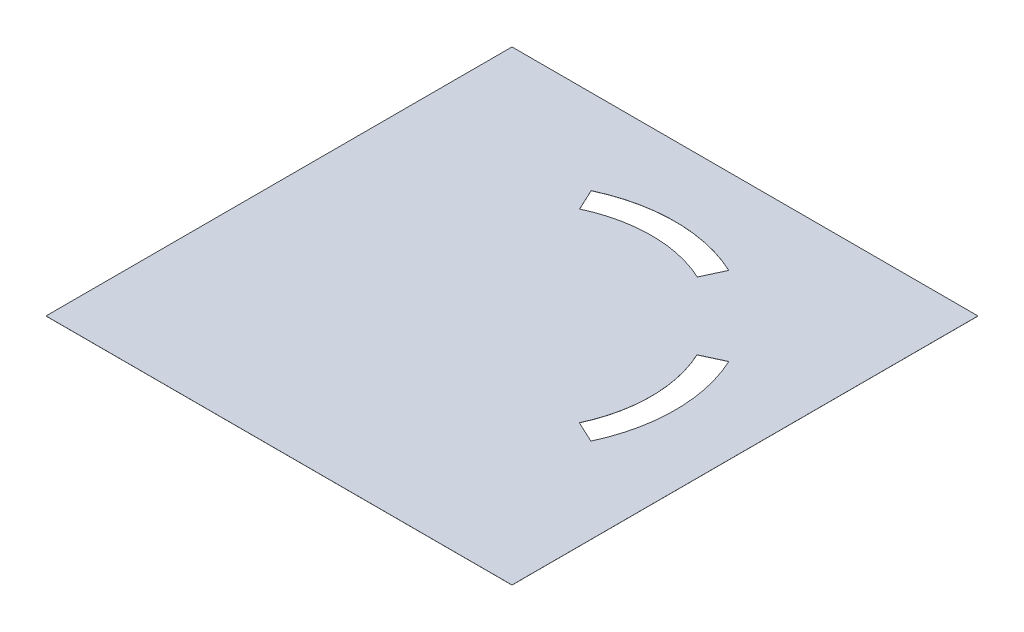
ISO-10303-21;
HEADER;
FILE_DESCRIPTION(('STEP AP214'),'2;1');
FILE_NAME('part.step','',(''),(''),'','','');
FILE_SCHEMA(('AUTOMOTIVE_DESIGN { 1 0 10303 214 1 1 1 1 }'));
ENDSEC;
DATA;
#1=APPLICATION_CONTEXT('core data for automotive mechanical design processes');
#2=APPLICATION_PROTOCOL_DEFINITION('international standard','automotive_design',2000,#1);
#3=PRODUCT_CONTEXT('',#1,'mechanical');
#4=PRODUCT('Part','Part','',(#3));
#5=PRODUCT_RELATED_PRODUCT_CATEGORY('part','',(#4));
#6=PRODUCT_DEFINITION_FORMATION('','',#4);
#7=PRODUCT_DEFINITION_CONTEXT('part definition',#1,'design');
#8=PRODUCT_DEFINITION('design','',#6,#7);
#9=PRODUCT_DEFINITION_SHAPE('','',#8);
#10=(LENGTH_UNIT() NAMED_UNIT(*) SI_UNIT(.MILLI.,.METRE.));
#11=(NAMED_UNIT(*) PLANE_ANGLE_UNIT() SI_UNIT($,.RADIAN.));
#12=(NAMED_UNIT(*) SI_UNIT($,.STERADIAN.) SOLID_ANGLE_UNIT());
#13=UNCERTAINTY_MEASURE_WITH_UNIT(LENGTH_MEASURE(1.E-05),#10,'distance_accuracy_value','');
#14=(GEOMETRIC_REPRESENTATION_CONTEXT(3) GLOBAL_UNCERTAINTY_ASSIGNED_CONTEXT((#13)) GLOBAL_UNIT_ASSIGNED_CONTEXT((#10,
#11,#12)) REPRESENTATION_CONTEXT('',''));
#15=CARTESIAN_POINT('',(0.,0.,0.));
#16=DIRECTION('',(0.,0.,1.));
#17=DIRECTION('',(1.,0.,0.));
#18=AXIS2_PLACEMENT_3D('',#15,#16,#17);
#19=CARTESIAN_POINT('',(26.5152534382806,0.015,-26.5149583428723));
#20=DIRECTION('',(0.,-1.,0.));
#21=DIRECTION('',(0.,0.,-1.));
#22=AXIS2_PLACEMENT_3D('',#19,#20,#21);
#23=PLANE('',#22);
#24=CARTESIAN_POINT('',(53.2898031206338,0.015,-53.2975764354662));
#25=DIRECTION('',(0.,-1.,0.));
#26=DIRECTION('',(0.,0.,-1.));
#27=AXIS2_PLACEMENT_3D('',#24,#25,#26);
#28=CIRCLE('',#27,16.0051180925938);
#29=CARTESIAN_POINT('',(46.5257479333873,0.015,-67.8031395952252));
#30=VERTEX_POINT('',#29);
#31=CARTESIAN_POINT('',(60.0538583078804,0.015,-67.8031395952251));
#32=VERTEX_POINT('',#31);
#33=EDGE_CURVE('E159',#30,#32,#28,.T.);
#34=ORIENTED_EDGE('',*,*,#33,.F.);
#35=DIRECTION('',(0.422618261740692,0.,0.906307787036653));
#36=VECTOR('',#35,1.);
#37=CARTESIAN_POINT('',(46.5257479333873,0.015,-67.8031395952252));
#38=LINE('',#37,#36);
#39=CARTESIAN_POINT('',(45.3628872132601,0.015,-70.2969024571269));
#40=VERTEX_POINT('',#39);
#41=EDGE_CURVE('E167',#40,#30,#38,.T.);
#42=ORIENTED_EDGE('',*,*,#41,.F.);
#43=CARTESIAN_POINT('',(53.2506374142511,0.015,-53.4572668260534));
#44=DIRECTION('',(0.,1.,0.));
#45=DIRECTION('',(0.,0.,-1.));
#46=AXIS2_PLACEMENT_3D('',#43,#44,#45);
#47=CIRCLE('',#46,18.5954277020066);
#48=CARTESIAN_POINT('',(61.2026196633013,0.015,-70.2666662719392));
#49=VERTEX_POINT('',#48);
#50=EDGE_CURVE('E164',#49,#40,#47,.T.);
#51=ORIENTED_EDGE('',*,*,#50,.F.);
#52=DIRECTION('',(0.422618261740697,0.,-0.906307787036651));
#53=VECTOR('',#52,1.);
#54=CARTESIAN_POINT('',(60.0538583078804,0.015,-67.8031395952251));
#55=LINE('',#54,#53);
#56=EDGE_CURVE('E161',#32,#49,#55,.T.);
#57=ORIENTED_EDGE('',*,*,#56,.F.);
#58=EDGE_LOOP('',(#34,#42,#51,#57));
#59=FACE_BOUND('',#58,.T.);
#60=DIRECTION('',(1.,0.,0.));
#61=VECTOR('',#60,1.);
#62=CARTESIAN_POINT('',(26.5152534382806,0.015,-26.5149583428723));
#63=LINE('',#62,#61);
#64=CARTESIAN_POINT('',(26.5152534382806,0.015,-26.5149583428723));
#65=VERTEX_POINT('',#64);
#66=CARTESIAN_POINT('',(80.0502534382806,0.015,-26.5149583428723));
#67=VERTEX_POINT('',#66);
#68=EDGE_CURVE('E190',#65,#67,#63,.T.);
#69=ORIENTED_EDGE('',*,*,#68,.T.);
#70=DIRECTION('',(0.,0.,-1.));
#71=VECTOR('',#70,1.);
#72=CARTESIAN_POINT('',(80.0502534382806,0.015,-80.0499583428723));
#73=LINE('',#72,#71);
#74=CARTESIAN_POINT('',(80.0502534382806,0.015,-80.0499583428723));
#75=VERTEX_POINT('',#74);
#76=EDGE_CURVE('E193',#67,#75,#73,.T.);
#77=ORIENTED_EDGE('',*,*,#76,.T.);
#78=DIRECTION('',(-1.,0.,0.));
#79=VECTOR('',#78,1.);
#80=CARTESIAN_POINT('',(26.5152534382806,0.015,-80.0499583428723));
#81=LINE('',#80,#79);
#82=CARTESIAN_POINT('',(26.5152534382806,0.015,-80.0499583428723));
#83=VERTEX_POINT('',#82);
#84=EDGE_CURVE('E196',#75,#83,#81,.T.);
#85=ORIENTED_EDGE('',*,*,#84,.T.);
#86=DIRECTION('',(0.,0.,1.));
#87=VECTOR('',#86,1.);
#88=CARTESIAN_POINT('',(26.5152534382806,0.015,-26.5149583428723));
#89=LINE('',#88,#87);
#90=EDGE_CURVE('E198',#83,#65,#89,.T.);
#91=ORIENTED_EDGE('',*,*,#90,.T.);
#92=EDGE_LOOP('',(#69,#77,#85,#91));
#93=FACE_BOUND('',#92,.T.);
#94=CARTESIAN_POINT('',(53.2827534382806,0.015,-53.2824583428723));
#95=DIRECTION('',(0.,-1.,0.));
#96=DIRECTION('',(0.,0.,-1.));
#97=AXIS2_PLACEMENT_3D('',#94,#95,#96);
#98=CIRCLE('',#97,15.99);
#99=CARTESIAN_POINT('',(67.7746149529967,0.015,-60.0401243481061));
#100=VERTEX_POINT('',#99);
#101=CARTESIAN_POINT('',(67.7746149529967,0.015,-46.5247923376385));
#102=VERTEX_POINT('',#101);
#103=EDGE_CURVE('E123',#100,#102,#98,.T.);
#104=ORIENTED_EDGE('',*,*,#103,.F.);
#105=DIRECTION('',(-0.906307787036649,0.,0.422618261740701));
#106=VECTOR('',#105,1.);
#107=CARTESIAN_POINT('',(67.7746149529967,0.015,-60.0401243481061));
#108=LINE('',#107,#106);
#109=CARTESIAN_POINT('',(70.2669613673474,0.015,-61.2023245678931));
#110=VERTEX_POINT('',#109);
#111=EDGE_CURVE('E145',#110,#100,#108,.T.);
#112=ORIENTED_EDGE('',*,*,#111,.F.);
#113=CARTESIAN_POINT('',(53.2827534382806,0.015,-53.2824583428723));
#114=DIRECTION('',(0.,1.,0.));
#115=DIRECTION('',(0.,0.,-1.));
#116=AXIS2_PLACEMENT_3D('',#113,#114,#115);
#117=CIRCLE('',#116,18.74);
#118=CARTESIAN_POINT('',(70.2669613673474,0.015,-45.3625921178516));
#119=VERTEX_POINT('',#118);
#120=EDGE_CURVE('E143',#119,#110,#117,.T.);
#121=ORIENTED_EDGE('',*,*,#120,.F.);
#122=DIRECTION('',(0.906307787036649,0.,0.422618261740701));
#123=VECTOR('',#122,1.);
#124=CARTESIAN_POINT('',(67.7746149529967,0.015,-46.5247923376385));
#125=LINE('',#124,#123);
#126=EDGE_CURVE('E131',#102,#119,#125,.T.);
#127=ORIENTED_EDGE('',*,*,#126,.F.);
#128=EDGE_LOOP('',(#104,#112,#121,#127));
#129=FACE_BOUND('',#128,.T.);
#130=ADVANCED_FACE('F34',(#59,#93,#129),#23,.F.);
#131=CARTESIAN_POINT('',(26.5152534382806,0.005,-26.5149583428723));
#132=DIRECTION('',(0.,-1.,0.));
#133=DIRECTION('',(0.,0.,-1.));
#134=AXIS2_PLACEMENT_3D('',#131,#132,#133);
#135=PLANE('',#134);
#136=DIRECTION('',(1.,0.,0.));
#137=VECTOR('',#136,1.);
#138=CARTESIAN_POINT('',(26.5152534382806,0.005,-26.5149583428723));
#139=LINE('',#138,#137);
#140=CARTESIAN_POINT('',(26.5152534382806,0.005,-26.5149583428723));
#141=VERTEX_POINT('',#140);
#142=CARTESIAN_POINT('',(80.0502534382806,0.005,-26.5149583428723));
#143=VERTEX_POINT('',#142);
#144=EDGE_CURVE('E189',#141,#143,#139,.T.);
#145=ORIENTED_EDGE('',*,*,#144,.F.);
#146=DIRECTION('',(0.,0.,1.));
#147=VECTOR('',#146,1.);
#148=CARTESIAN_POINT('',(26.5152534382806,0.005,-26.5149583428723));
#149=LINE('',#148,#147);
#150=CARTESIAN_POINT('',(26.5152534382806,0.005,-80.0499583428723));
#151=VERTEX_POINT('',#150);
#152=EDGE_CURVE('E194',#151,#141,#149,.T.);
#153=ORIENTED_EDGE('',*,*,#152,.F.);
#154=DIRECTION('',(-1.,0.,0.));
#155=VECTOR('',#154,1.);
#156=CARTESIAN_POINT('',(26.5152534382806,0.005,-80.0499583428723));
#157=LINE('',#156,#155);
#158=CARTESIAN_POINT('',(80.0502534382806,0.005,-80.0499583428723));
#159=VERTEX_POINT('',#158);
#160=EDGE_CURVE('E205',#159,#151,#157,.T.);
#161=ORIENTED_EDGE('',*,*,#160,.F.);
#162=DIRECTION('',(0.,0.,-1.));
#163=VECTOR('',#162,1.);
#164=CARTESIAN_POINT('',(80.0502534382806,0.005,-80.0499583428723));
#165=LINE('',#164,#163);
#166=EDGE_CURVE('E203',#143,#159,#165,.T.);
#167=ORIENTED_EDGE('',*,*,#166,.F.);
#168=EDGE_LOOP('',(#145,#153,#161,#167));
#169=FACE_BOUND('',#168,.T.);
#170=DIRECTION('',(0.422618261740692,0.,0.906307787036653));
#171=VECTOR('',#170,1.);
#172=CARTESIAN_POINT('',(46.5257479333873,0.005,-67.8031395952252));
#173=LINE('',#172,#171);
#174=CARTESIAN_POINT('',(45.3628872132601,0.005,-70.2969024571269));
#175=VERTEX_POINT('',#174);
#176=CARTESIAN_POINT('',(46.5257479333873,0.005,-67.8031395952252));
#177=VERTEX_POINT('',#176);
#178=EDGE_CURVE('E162',#175,#177,#173,.T.);
#179=ORIENTED_EDGE('',*,*,#178,.T.);
#180=CARTESIAN_POINT('',(53.2898031206338,0.005,-53.2975764354662));
#181=DIRECTION('',(0.,-1.,0.));
#182=DIRECTION('',(0.,0.,-1.));
#183=AXIS2_PLACEMENT_3D('',#180,#181,#182);
#184=CIRCLE('',#183,16.0051180925938);
#185=CARTESIAN_POINT('',(60.0538583078804,0.005,-67.8031395952251));
#186=VERTEX_POINT('',#185);
#187=EDGE_CURVE('E139',#177,#186,#184,.T.);
#188=ORIENTED_EDGE('',*,*,#187,.T.);
#189=DIRECTION('',(0.422618261740697,0.,-0.906307787036651));
#190=VECTOR('',#189,1.);
#191=CARTESIAN_POINT('',(60.0538583078804,0.005,-67.8031395952251));
#192=LINE('',#191,#190);
#193=CARTESIAN_POINT('',(61.2026196633013,0.005,-70.2666662719392));
#194=VERTEX_POINT('',#193);
#195=EDGE_CURVE('E172',#186,#194,#192,.T.);
#196=ORIENTED_EDGE('',*,*,#195,.T.);
#197=CARTESIAN_POINT('',(53.2506374142511,0.005,-53.4572668260534));
#198=DIRECTION('',(0.,1.,0.));
#199=DIRECTION('',(0.,0.,-1.));
#200=AXIS2_PLACEMENT_3D('',#197,#198,#199);
#201=CIRCLE('',#200,18.5954277020066);
#202=EDGE_CURVE('E175',#194,#175,#201,.T.);
#203=ORIENTED_EDGE('',*,*,#202,.T.);
#204=EDGE_LOOP('',(#179,#188,#196,#203));
#205=FACE_BOUND('',#204,.T.);
#206=DIRECTION('',(-0.906307787036649,0.,0.422618261740701));
#207=VECTOR('',#206,1.);
#208=CARTESIAN_POINT('',(67.7746149529967,0.005,-60.0401243481061));
#209=LINE('',#208,#207);
#210=CARTESIAN_POINT('',(70.2669613673474,0.005,-61.2023245678931));
#211=VERTEX_POINT('',#210);
#212=CARTESIAN_POINT('',(67.7746149529966,0.005,-60.0401243481061));
#213=VERTEX_POINT('',#212);
#214=EDGE_CURVE('E132',#211,#213,#209,.T.);
#215=ORIENTED_EDGE('',*,*,#214,.T.);
#216=CARTESIAN_POINT('',(53.2827534382806,0.005,-53.2824583428723));
#217=DIRECTION('',(0.,-1.,0.));
#218=DIRECTION('',(0.,0.,-1.));
#219=AXIS2_PLACEMENT_3D('',#216,#217,#218);
#220=CIRCLE('',#219,15.99);
#221=CARTESIAN_POINT('',(67.7746149529967,0.005,-46.5247923376385));
#222=VERTEX_POINT('',#221);
#223=EDGE_CURVE('E57',#213,#222,#220,.T.);
#224=ORIENTED_EDGE('',*,*,#223,.T.);
#225=DIRECTION('',(0.906307787036649,0.,0.422618261740701));
#226=VECTOR('',#225,1.);
#227=CARTESIAN_POINT('',(67.7746149529967,0.005,-46.5247923376385));
#228=LINE('',#227,#226);
#229=CARTESIAN_POINT('',(70.2669613673474,0.005,-45.3625921178516));
#230=VERTEX_POINT('',#229);
#231=EDGE_CURVE('E138',#222,#230,#228,.T.);
#232=ORIENTED_EDGE('',*,*,#231,.T.);
#233=CARTESIAN_POINT('',(53.2827534382806,0.005,-53.2824583428723));
#234=DIRECTION('',(0.,1.,0.));
#235=DIRECTION('',(0.,0.,-1.));
#236=AXIS2_PLACEMENT_3D('',#233,#234,#235);
#237=CIRCLE('',#236,18.74);
#238=EDGE_CURVE('E151',#230,#211,#237,.T.);
#239=ORIENTED_EDGE('',*,*,#238,.T.);
#240=EDGE_LOOP('',(#215,#224,#232,#239));
#241=FACE_BOUND('',#240,.T.);
#242=ADVANCED_FACE('F223',(#169,#205,#241),#135,.T.);
#243=CARTESIAN_POINT('',(26.5152534382806,0.015,-26.5149583428723));
#244=DIRECTION('',(0.,0.,-1.));
#245=DIRECTION('',(-1.,0.,0.));
#246=AXIS2_PLACEMENT_3D('',#243,#244,#245);
#247=PLANE('',#246);
#248=ORIENTED_EDGE('',*,*,#144,.T.);
#249=DIRECTION('',(0.,-1.,0.));
#250=VECTOR('',#249,1.);
#251=CARTESIAN_POINT('',(80.0502534382806,0.015,-26.5149583428723));
#252=LINE('',#251,#250);
#253=EDGE_CURVE('E11',#67,#143,#252,.T.);
#254=ORIENTED_EDGE('',*,*,#253,.F.);
#255=ORIENTED_EDGE('',*,*,#68,.F.);
#256=DIRECTION('',(0.,-1.,0.));
#257=VECTOR('',#256,1.);
#258=CARTESIAN_POINT('',(26.5152534382806,0.015,-26.5149583428723));
#259=LINE('',#258,#257);
#260=EDGE_CURVE('E200',#65,#141,#259,.T.);
#261=ORIENTED_EDGE('',*,*,#260,.T.);
#262=EDGE_LOOP('',(#248,#254,#255,#261));
#263=FACE_BOUND('',#262,.T.);
#264=ADVANCED_FACE('F36',(#263),#247,.F.);
#265=CARTESIAN_POINT('',(80.0502534382806,0.015,-80.0499583428723));
#266=DIRECTION('',(-1.,0.,0.));
#267=DIRECTION('',(0.,0.,1.));
#268=AXIS2_PLACEMENT_3D('',#265,#266,#267);
#269=PLANE('',#268);
#270=ORIENTED_EDGE('',*,*,#166,.T.);
#271=DIRECTION('',(0.,-1.,0.));
#272=VECTOR('',#271,1.);
#273=CARTESIAN_POINT('',(80.0502534382806,0.015,-80.0499583428723));
#274=LINE('',#273,#272);
#275=EDGE_CURVE('E42',#75,#159,#274,.T.);
#276=ORIENTED_EDGE('',*,*,#275,.F.);
#277=ORIENTED_EDGE('',*,*,#76,.F.);
#278=ORIENTED_EDGE('',*,*,#253,.T.);
#279=EDGE_LOOP('',(#270,#276,#277,#278));
#280=FACE_BOUND('',#279,.T.);
#281=ADVANCED_FACE('F233',(#280),#269,.F.);
#282=CARTESIAN_POINT('',(26.5152534382806,0.015,-80.0499583428723));
#283=DIRECTION('',(0.,0.,1.));
#284=DIRECTION('',(1.,0.,0.));
#285=AXIS2_PLACEMENT_3D('',#282,#283,#284);
#286=PLANE('',#285);
#287=ORIENTED_EDGE('',*,*,#160,.T.);
#288=DIRECTION('',(0.,-1.,0.));
#289=VECTOR('',#288,1.);
#290=CARTESIAN_POINT('',(26.5152534382806,0.015,-80.0499583428723));
#291=LINE('',#290,#289);
#292=EDGE_CURVE('E210',#83,#151,#291,.T.);
#293=ORIENTED_EDGE('',*,*,#292,.F.);
#294=ORIENTED_EDGE('',*,*,#84,.F.);
#295=ORIENTED_EDGE('',*,*,#275,.T.);
#296=EDGE_LOOP('',(#287,#293,#294,#295));
#297=FACE_BOUND('',#296,.T.);
#298=ADVANCED_FACE('F217',(#297),#286,.F.);
#299=CARTESIAN_POINT('',(26.5152534382806,0.015,-26.5149583428723));
#300=DIRECTION('',(1.,0.,0.));
#301=DIRECTION('',(0.,0.,-1.));
#302=AXIS2_PLACEMENT_3D('',#299,#300,#301);
#303=PLANE('',#302);
#304=ORIENTED_EDGE('',*,*,#152,.T.);
#305=ORIENTED_EDGE('',*,*,#260,.F.);
#306=ORIENTED_EDGE('',*,*,#90,.F.);
#307=ORIENTED_EDGE('',*,*,#292,.T.);
#308=EDGE_LOOP('',(#304,#305,#306,#307));
#309=FACE_BOUND('',#308,.T.);
#310=ADVANCED_FACE('F227',(#309),#303,.F.);
#311=CARTESIAN_POINT('',(53.2898031206338,0.015,-53.2975764354662));
#312=DIRECTION('',(0.,-1.,0.));
#313=DIRECTION('',(0.,0.,-1.));
#314=AXIS2_PLACEMENT_3D('',#311,#312,#313);
#315=CYLINDRICAL_SURFACE('',#314,16.0051180925938);
#316=ORIENTED_EDGE('',*,*,#187,.F.);
#317=DIRECTION('',(0.,-1.,0.));
#318=VECTOR('',#317,1.);
#319=CARTESIAN_POINT('',(46.5257479333873,0.015,-67.8031395952252));
#320=LINE('',#319,#318);
#321=EDGE_CURVE('E169',#30,#177,#320,.T.);
#322=ORIENTED_EDGE('',*,*,#321,.F.);
#323=ORIENTED_EDGE('',*,*,#33,.T.);
#324=DIRECTION('',(0.,-1.,0.));
#325=VECTOR('',#324,1.);
#326=CARTESIAN_POINT('',(60.0538583078804,0.015,-67.8031395952251));
#327=LINE('',#326,#325);
#328=EDGE_CURVE('E186',#32,#186,#327,.T.);
#329=ORIENTED_EDGE('',*,*,#328,.T.);
#330=EDGE_LOOP('',(#316,#322,#323,#329));
#331=FACE_BOUND('',#330,.T.);
#332=ADVANCED_FACE('F249',(#331),#315,.T.);
#333=CARTESIAN_POINT('',(60.0538583078804,0.015,-67.8031395952251));
#334=DIRECTION('',(-0.906307787036651,0.,-0.422618261740697));
#335=DIRECTION('',(-0.422618261740697,0.,0.906307787036651));
#336=AXIS2_PLACEMENT_3D('',#333,#334,#335);
#337=PLANE('',#336);
#338=ORIENTED_EDGE('',*,*,#195,.F.);
#339=ORIENTED_EDGE('',*,*,#328,.F.);
#340=ORIENTED_EDGE('',*,*,#56,.T.);
#341=DIRECTION('',(0.,-1.,0.));
#342=VECTOR('',#341,1.);
#343=CARTESIAN_POINT('',(61.2026196633013,0.015,-70.2666662719392));
#344=LINE('',#343,#342);
#345=EDGE_CURVE('E184',#49,#194,#344,.T.);
#346=ORIENTED_EDGE('',*,*,#345,.T.);
#347=EDGE_LOOP('',(#338,#339,#340,#346));
#348=FACE_BOUND('',#347,.T.);
#349=ADVANCED_FACE('F256',(#348),#337,.T.);
#350=CARTESIAN_POINT('',(53.2506374142511,0.015,-53.4572668260534));
#351=DIRECTION('',(0.,-1.,0.));
#352=DIRECTION('',(0.,0.,-1.));
#353=AXIS2_PLACEMENT_3D('',#350,#351,#352);
#354=CYLINDRICAL_SURFACE('',#353,18.5954277020066);
#355=ORIENTED_EDGE('',*,*,#202,.F.);
#356=ORIENTED_EDGE('',*,*,#345,.F.);
#357=ORIENTED_EDGE('',*,*,#50,.T.);
#358=DIRECTION('',(0.,-1.,0.));
#359=VECTOR('',#358,1.);
#360=CARTESIAN_POINT('',(45.3628872132601,0.015,-70.2969024571269));
#361=LINE('',#360,#359);
#362=EDGE_CURVE('E182',#40,#175,#361,.T.);
#363=ORIENTED_EDGE('',*,*,#362,.T.);
#364=EDGE_LOOP('',(#355,#356,#357,#363));
#365=FACE_BOUND('',#364,.T.);
#366=ADVANCED_FACE('F261',(#365),#354,.F.);
#367=CARTESIAN_POINT('',(46.5257479333873,0.015,-67.8031395952252));
#368=DIRECTION('',(0.906307787036653,0.,-0.422618261740692));
#369=DIRECTION('',(-0.422618261740692,0.,-0.906307787036653));
#370=AXIS2_PLACEMENT_3D('',#367,#368,#369);
#371=PLANE('',#370);
#372=ORIENTED_EDGE('',*,*,#178,.F.);
#373=ORIENTED_EDGE('',*,*,#362,.F.);
#374=ORIENTED_EDGE('',*,*,#41,.T.);
#375=ORIENTED_EDGE('',*,*,#321,.T.);
#376=EDGE_LOOP('',(#372,#373,#374,#375));
#377=FACE_BOUND('',#376,.T.);
#378=ADVANCED_FACE('F267',(#377),#371,.T.);
#379=CARTESIAN_POINT('',(53.2827534382806,0.015,-53.2824583428723));
#380=DIRECTION('',(0.,-1.,0.));
#381=DIRECTION('',(0.,0.,-1.));
#382=AXIS2_PLACEMENT_3D('',#379,#380,#381);
#383=CYLINDRICAL_SURFACE('',#382,15.99);
#384=ORIENTED_EDGE('',*,*,#223,.F.);
#385=DIRECTION('',(0.,-1.,0.));
#386=VECTOR('',#385,1.);
#387=CARTESIAN_POINT('',(67.7746149529967,0.015,-60.0401243481061));
#388=LINE('',#387,#386);
#389=EDGE_CURVE('E127',#100,#213,#388,.T.);
#390=ORIENTED_EDGE('',*,*,#389,.F.);
#391=ORIENTED_EDGE('',*,*,#103,.T.);
#392=DIRECTION('',(0.,-1.,0.));
#393=VECTOR('',#392,1.);
#394=CARTESIAN_POINT('',(67.7746149529967,0.015,-46.5247923376385));
#395=LINE('',#394,#393);
#396=EDGE_CURVE('E126',#102,#222,#395,.T.);
#397=ORIENTED_EDGE('',*,*,#396,.T.);
#398=EDGE_LOOP('',(#384,#390,#391,#397));
#399=FACE_BOUND('',#398,.T.);
#400=ADVANCED_FACE('F125',(#399),#383,.T.);
#401=CARTESIAN_POINT('',(67.7746149529967,0.015,-46.5247923376385));
#402=DIRECTION('',(0.422618261740701,0.,-0.906307787036649));
#403=DIRECTION('',(-0.906307787036649,0.,-0.422618261740701));
#404=AXIS2_PLACEMENT_3D('',#401,#402,#403);
#405=PLANE('',#404);
#406=ORIENTED_EDGE('',*,*,#231,.F.);
#407=ORIENTED_EDGE('',*,*,#396,.F.);
#408=ORIENTED_EDGE('',*,*,#126,.T.);
#409=DIRECTION('',(0.,-1.,0.));
#410=VECTOR('',#409,1.);
#411=CARTESIAN_POINT('',(70.2669613673474,0.015,-45.3625921178516));
#412=LINE('',#411,#410);
#413=EDGE_CURVE('E140',#119,#230,#412,.T.);
#414=ORIENTED_EDGE('',*,*,#413,.T.);
#415=EDGE_LOOP('',(#406,#407,#408,#414));
#416=FACE_BOUND('',#415,.T.);
#417=ADVANCED_FACE('F135',(#416),#405,.T.);
#418=CARTESIAN_POINT('',(53.2827534382806,0.015,-53.2824583428723));
#419=DIRECTION('',(0.,-1.,0.));
#420=DIRECTION('',(0.,0.,-1.));
#421=AXIS2_PLACEMENT_3D('',#418,#419,#420);
#422=CYLINDRICAL_SURFACE('',#421,18.74);
#423=ORIENTED_EDGE('',*,*,#238,.F.);
#424=ORIENTED_EDGE('',*,*,#413,.F.);
#425=ORIENTED_EDGE('',*,*,#120,.T.);
#426=DIRECTION('',(0.,-1.,0.));
#427=VECTOR('',#426,1.);
#428=CARTESIAN_POINT('',(70.2669613673474,0.015,-61.2023245678931));
#429=LINE('',#428,#427);
#430=EDGE_CURVE('E49',#110,#211,#429,.T.);
#431=ORIENTED_EDGE('',*,*,#430,.T.);
#432=EDGE_LOOP('',(#423,#424,#425,#431));
#433=FACE_BOUND('',#432,.T.);
#434=ADVANCED_FACE('F286',(#433),#422,.F.);
#435=CARTESIAN_POINT('',(67.7746149529967,0.015,-60.0401243481061));
#436=DIRECTION('',(0.422618261740701,0.,0.906307787036649));
#437=DIRECTION('',(0.906307787036649,0.,-0.422618261740701));
#438=AXIS2_PLACEMENT_3D('',#435,#436,#437);
#439=PLANE('',#438);
#440=ORIENTED_EDGE('',*,*,#214,.F.);
#441=ORIENTED_EDGE('',*,*,#430,.F.);
#442=ORIENTED_EDGE('',*,*,#111,.T.);
#443=ORIENTED_EDGE('',*,*,#389,.T.);
#444=EDGE_LOOP('',(#440,#441,#442,#443));
#445=FACE_BOUND('',#444,.T.);
#446=ADVANCED_FACE('F289',(#445),#439,.T.);
#447=CLOSED_SHELL('',(#130,#242,#264,#281,#298,#310,#332,#349,#366,#378,#400,#417,#434,#446));
#448=MANIFOLD_SOLID_BREP('B2',#447);
#449=ADVANCED_BREP_SHAPE_REPRESENTATION('',(#18,#448),#14);
#450=SHAPE_DEFINITION_REPRESENTATION(#9,#449);
ENDSEC;
END-ISO-10303-21;
